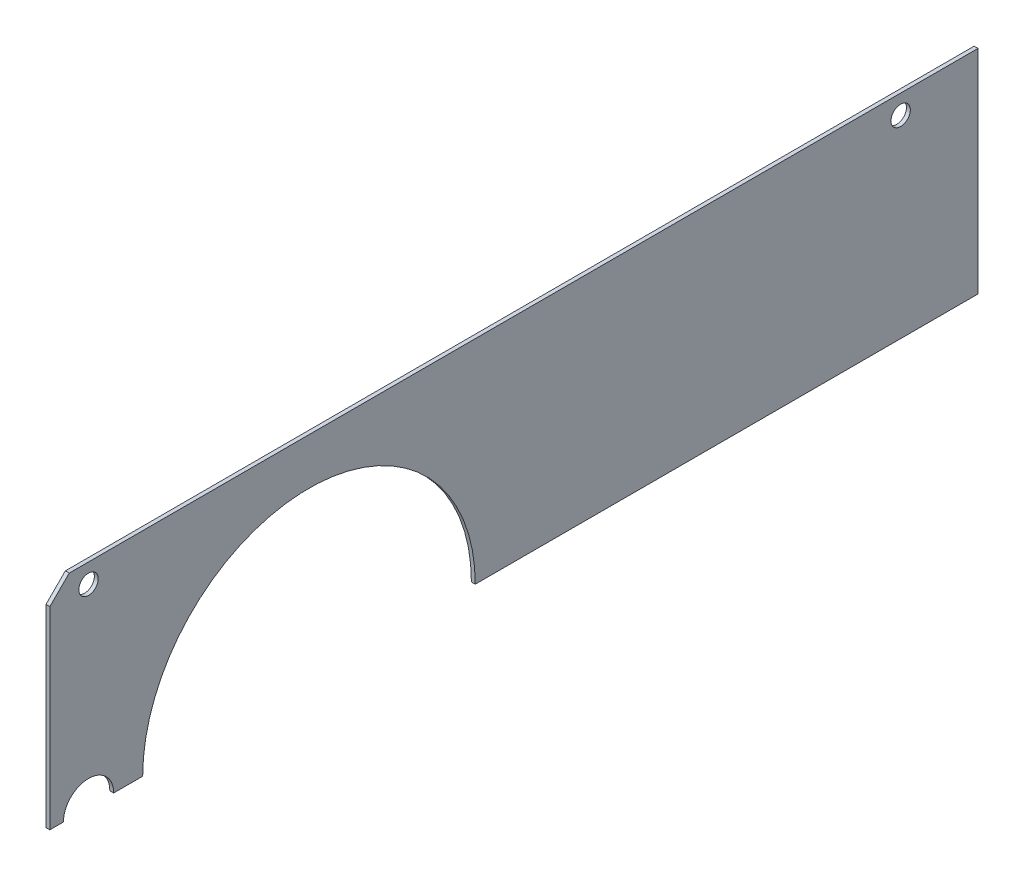
ISO-10303-21;
HEADER;
FILE_DESCRIPTION(('STEP AP214'),'2;1');
FILE_NAME('part.step','',(''),(''),'','','');
FILE_SCHEMA(('AUTOMOTIVE_DESIGN { 1 0 10303 214 1 1 1 1 }'));
ENDSEC;
DATA;
#1=APPLICATION_CONTEXT('core data for automotive mechanical design processes');
#2=APPLICATION_PROTOCOL_DEFINITION('international standard','automotive_design',2000,#1);
#3=PRODUCT_CONTEXT('',#1,'mechanical');
#4=PRODUCT('Part','Part','',(#3));
#5=PRODUCT_RELATED_PRODUCT_CATEGORY('part','',(#4));
#6=PRODUCT_DEFINITION_FORMATION('','',#4);
#7=PRODUCT_DEFINITION_CONTEXT('part definition',#1,'design');
#8=PRODUCT_DEFINITION('design','',#6,#7);
#9=PRODUCT_DEFINITION_SHAPE('','',#8);
#10=(LENGTH_UNIT() NAMED_UNIT(*) SI_UNIT(.MILLI.,.METRE.));
#11=(NAMED_UNIT(*) PLANE_ANGLE_UNIT() SI_UNIT($,.RADIAN.));
#12=(NAMED_UNIT(*) SI_UNIT($,.STERADIAN.) SOLID_ANGLE_UNIT());
#13=UNCERTAINTY_MEASURE_WITH_UNIT(LENGTH_MEASURE(1.E-05),#10,'distance_accuracy_value','');
#14=(GEOMETRIC_REPRESENTATION_CONTEXT(3) GLOBAL_UNCERTAINTY_ASSIGNED_CONTEXT((#13)) GLOBAL_UNIT_ASSIGNED_CONTEXT((#10,
#11,#12)) REPRESENTATION_CONTEXT('',''));
#15=CARTESIAN_POINT('',(0.,0.,0.));
#16=DIRECTION('',(0.,0.,1.));
#17=DIRECTION('',(1.,0.,0.));
#18=AXIS2_PLACEMENT_3D('',#15,#16,#17);
#19=CARTESIAN_POINT('',(0.,27.5,-120.));
#20=DIRECTION('',(1.,0.,0.));
#21=DIRECTION('',(0.,1.,0.));
#22=AXIS2_PLACEMENT_3D('',#19,#20,#21);
#23=PLANE('',#22);
#24=CARTESIAN_POINT('',(0.,50.,-220.));
#25=DIRECTION('',(-1.,0.,0.));
#26=DIRECTION('',(0.,-1.,0.));
#27=AXIS2_PLACEMENT_3D('',#24,#25,#26);
#28=CIRCLE('',#27,2.5);
#29=CARTESIAN_POINT('',(0.,52.5,-220.));
#30=VERTEX_POINT('',#29);
#31=EDGE_CURVE('E21',#30,#30,#28,.T.);
#32=ORIENTED_EDGE('',*,*,#31,.F.);
#33=EDGE_LOOP('',(#32));
#34=FACE_BOUND('',#33,.T.);
#35=CARTESIAN_POINT('',(0.,50.,-10.));
#36=DIRECTION('',(-1.,0.,0.));
#37=DIRECTION('',(0.,-1.,0.));
#38=AXIS2_PLACEMENT_3D('',#35,#36,#37);
#39=CIRCLE('',#38,2.5);
#40=CARTESIAN_POINT('',(0.,52.5,-10.));
#41=VERTEX_POINT('',#40);
#42=EDGE_CURVE('E144',#41,#41,#39,.T.);
#43=ORIENTED_EDGE('',*,*,#42,.F.);
#44=EDGE_LOOP('',(#43));
#45=FACE_BOUND('',#44,.T.);
#46=DIRECTION('',(0.,-1.,0.));
#47=VECTOR('',#46,1.);
#48=CARTESIAN_POINT('',(0.,50.,0.));
#49=LINE('',#48,#47);
#50=CARTESIAN_POINT('',(0.,50.,0.));
#51=VERTEX_POINT('',#50);
#52=CARTESIAN_POINT('',(0.,0.,0.));
#53=VERTEX_POINT('',#52);
#54=EDGE_CURVE('E28',#51,#53,#49,.T.);
#55=ORIENTED_EDGE('',*,*,#54,.F.);
#56=DIRECTION('',(0.,-0.707106781186548,0.707106781186548));
#57=VECTOR('',#56,1.);
#58=CARTESIAN_POINT('',(0.,55.,-5.));
#59=LINE('',#58,#57);
#60=CARTESIAN_POINT('',(0.,55.,-5.));
#61=VERTEX_POINT('',#60);
#62=EDGE_CURVE('E135',#61,#51,#59,.T.);
#63=ORIENTED_EDGE('',*,*,#62,.F.);
#64=DIRECTION('',(0.,0.,1.));
#65=VECTOR('',#64,1.);
#66=CARTESIAN_POINT('',(0.,55.,-240.));
#67=LINE('',#66,#65);
#68=CARTESIAN_POINT('',(0.,55.,-240.));
#69=VERTEX_POINT('',#68);
#70=EDGE_CURVE('E169',#69,#61,#67,.T.);
#71=ORIENTED_EDGE('',*,*,#70,.F.);
#72=DIRECTION('',(0.,1.,0.));
#73=VECTOR('',#72,1.);
#74=CARTESIAN_POINT('',(0.,0.,-240.));
#75=LINE('',#74,#73);
#76=CARTESIAN_POINT('',(0.,0.,-240.));
#77=VERTEX_POINT('',#76);
#78=EDGE_CURVE('E149',#77,#69,#75,.T.);
#79=ORIENTED_EDGE('',*,*,#78,.F.);
#80=DIRECTION('',(0.,0.,-1.));
#81=VECTOR('',#80,1.);
#82=CARTESIAN_POINT('',(0.,0.,-110.));
#83=LINE('',#82,#81);
#84=CARTESIAN_POINT('',(0.,0.,-110.));
#85=VERTEX_POINT('',#84);
#86=EDGE_CURVE('E208',#85,#77,#83,.T.);
#87=ORIENTED_EDGE('',*,*,#86,.F.);
#88=CARTESIAN_POINT('',(0.,0.,-67.));
#89=DIRECTION('',(-1.,0.,0.));
#90=DIRECTION('',(0.,0.,1.));
#91=AXIS2_PLACEMENT_3D('',#88,#89,#90);
#92=CIRCLE('',#91,43.);
#93=CARTESIAN_POINT('',(0.,0.,-24.));
#94=VERTEX_POINT('',#93);
#95=EDGE_CURVE('E161',#94,#85,#92,.T.);
#96=ORIENTED_EDGE('',*,*,#95,.F.);
#97=DIRECTION('',(0.,0.,-1.));
#98=VECTOR('',#97,1.);
#99=CARTESIAN_POINT('',(0.,0.,-16.5));
#100=LINE('',#99,#98);
#101=CARTESIAN_POINT('',(0.,0.,-16.5));
#102=VERTEX_POINT('',#101);
#103=EDGE_CURVE('E128',#102,#94,#100,.T.);
#104=ORIENTED_EDGE('',*,*,#103,.F.);
#105=CARTESIAN_POINT('',(0.,0.,-10.));
#106=DIRECTION('',(-1.,0.,0.));
#107=DIRECTION('',(0.,0.,1.));
#108=AXIS2_PLACEMENT_3D('',#105,#106,#107);
#109=CIRCLE('',#108,6.5);
#110=CARTESIAN_POINT('',(0.,0.,-3.5));
#111=VERTEX_POINT('',#110);
#112=EDGE_CURVE('E113',#111,#102,#109,.T.);
#113=ORIENTED_EDGE('',*,*,#112,.F.);
#114=DIRECTION('',(0.,0.,-1.));
#115=VECTOR('',#114,1.);
#116=CARTESIAN_POINT('',(0.,0.,0.));
#117=LINE('',#116,#115);
#118=EDGE_CURVE('E141',#53,#111,#117,.T.);
#119=ORIENTED_EDGE('',*,*,#118,.F.);
#120=EDGE_LOOP('',(#55,#63,#71,#79,#87,#96,#104,#113,#119));
#121=FACE_BOUND('',#120,.T.);
#122=ADVANCED_FACE('F17',(#34,#45,#121),#23,.F.);
#123=CARTESIAN_POINT('',(1.,27.5,-120.));
#124=DIRECTION('',(1.,0.,0.));
#125=DIRECTION('',(0.,1.,0.));
#126=AXIS2_PLACEMENT_3D('',#123,#124,#125);
#127=PLANE('',#126);
#128=CARTESIAN_POINT('',(1.,50.,-220.));
#129=DIRECTION('',(-1.,0.,0.));
#130=DIRECTION('',(0.,-1.,0.));
#131=AXIS2_PLACEMENT_3D('',#128,#129,#130);
#132=CIRCLE('',#131,2.5);
#133=CARTESIAN_POINT('',(1.,52.5,-220.));
#134=VERTEX_POINT('',#133);
#135=EDGE_CURVE('E194',#134,#134,#132,.T.);
#136=ORIENTED_EDGE('',*,*,#135,.T.);
#137=EDGE_LOOP('',(#136));
#138=FACE_BOUND('',#137,.T.);
#139=CARTESIAN_POINT('',(1.,50.,-10.));
#140=DIRECTION('',(-1.,0.,0.));
#141=DIRECTION('',(0.,-1.,0.));
#142=AXIS2_PLACEMENT_3D('',#139,#140,#141);
#143=CIRCLE('',#142,2.5);
#144=CARTESIAN_POINT('',(1.,52.5,-10.));
#145=VERTEX_POINT('',#144);
#146=EDGE_CURVE('E187',#145,#145,#143,.T.);
#147=ORIENTED_EDGE('',*,*,#146,.T.);
#148=EDGE_LOOP('',(#147));
#149=FACE_BOUND('',#148,.T.);
#150=DIRECTION('',(0.,-1.,0.));
#151=VECTOR('',#150,1.);
#152=CARTESIAN_POINT('',(1.,50.,0.));
#153=LINE('',#152,#151);
#154=CARTESIAN_POINT('',(1.,50.,0.));
#155=VERTEX_POINT('',#154);
#156=CARTESIAN_POINT('',(1.,0.,0.));
#157=VERTEX_POINT('',#156);
#158=EDGE_CURVE('E11',#155,#157,#153,.T.);
#159=ORIENTED_EDGE('',*,*,#158,.T.);
#160=DIRECTION('',(0.,0.,-1.));
#161=VECTOR('',#160,1.);
#162=CARTESIAN_POINT('',(1.,0.,0.));
#163=LINE('',#162,#161);
#164=CARTESIAN_POINT('',(1.,0.,-3.5));
#165=VERTEX_POINT('',#164);
#166=EDGE_CURVE('E107',#157,#165,#163,.T.);
#167=ORIENTED_EDGE('',*,*,#166,.T.);
#168=CARTESIAN_POINT('',(1.,0.,-10.));
#169=DIRECTION('',(-1.,0.,0.));
#170=DIRECTION('',(0.,0.,1.));
#171=AXIS2_PLACEMENT_3D('',#168,#169,#170);
#172=CIRCLE('',#171,6.5);
#173=CARTESIAN_POINT('',(1.,0.,-16.5));
#174=VERTEX_POINT('',#173);
#175=EDGE_CURVE('E100',#165,#174,#172,.T.);
#176=ORIENTED_EDGE('',*,*,#175,.T.);
#177=DIRECTION('',(0.,0.,-1.));
#178=VECTOR('',#177,1.);
#179=CARTESIAN_POINT('',(1.,0.,-16.5));
#180=LINE('',#179,#178);
#181=CARTESIAN_POINT('',(1.,0.,-24.));
#182=VERTEX_POINT('',#181);
#183=EDGE_CURVE('E104',#174,#182,#180,.T.);
#184=ORIENTED_EDGE('',*,*,#183,.T.);
#185=CARTESIAN_POINT('',(1.,0.,-67.));
#186=DIRECTION('',(-1.,0.,0.));
#187=DIRECTION('',(0.,0.,1.));
#188=AXIS2_PLACEMENT_3D('',#185,#186,#187);
#189=CIRCLE('',#188,43.);
#190=CARTESIAN_POINT('',(1.,0.,-110.));
#191=VERTEX_POINT('',#190);
#192=EDGE_CURVE('E177',#182,#191,#189,.T.);
#193=ORIENTED_EDGE('',*,*,#192,.T.);
#194=DIRECTION('',(0.,0.,-1.));
#195=VECTOR('',#194,1.);
#196=CARTESIAN_POINT('',(1.,0.,-110.));
#197=LINE('',#196,#195);
#198=CARTESIAN_POINT('',(1.,0.,-240.));
#199=VERTEX_POINT('',#198);
#200=EDGE_CURVE('E162',#191,#199,#197,.T.);
#201=ORIENTED_EDGE('',*,*,#200,.T.);
#202=DIRECTION('',(0.,1.,0.));
#203=VECTOR('',#202,1.);
#204=CARTESIAN_POINT('',(1.,0.,-240.));
#205=LINE('',#204,#203);
#206=CARTESIAN_POINT('',(1.,55.,-240.));
#207=VERTEX_POINT('',#206);
#208=EDGE_CURVE('E153',#199,#207,#205,.T.);
#209=ORIENTED_EDGE('',*,*,#208,.T.);
#210=DIRECTION('',(0.,0.,1.));
#211=VECTOR('',#210,1.);
#212=CARTESIAN_POINT('',(1.,55.,-240.));
#213=LINE('',#212,#211);
#214=CARTESIAN_POINT('',(1.,55.,-5.));
#215=VERTEX_POINT('',#214);
#216=EDGE_CURVE('E166',#207,#215,#213,.T.);
#217=ORIENTED_EDGE('',*,*,#216,.T.);
#218=DIRECTION('',(0.,-0.707106781186548,0.707106781186548));
#219=VECTOR('',#218,1.);
#220=CARTESIAN_POINT('',(1.,55.,-5.));
#221=LINE('',#220,#219);
#222=EDGE_CURVE('E174',#215,#155,#221,.T.);
#223=ORIENTED_EDGE('',*,*,#222,.T.);
#224=EDGE_LOOP('',(#159,#167,#176,#184,#193,#201,#209,#217,#223));
#225=FACE_BOUND('',#224,.T.);
#226=ADVANCED_FACE('F102',(#138,#149,#225),#127,.T.);
#227=CARTESIAN_POINT('',(0.,50.,0.));
#228=DIRECTION('',(0.,0.,1.));
#229=DIRECTION('',(1.,0.,0.));
#230=AXIS2_PLACEMENT_3D('',#227,#228,#229);
#231=PLANE('',#230);
#232=ORIENTED_EDGE('',*,*,#54,.T.);
#233=DIRECTION('',(1.,0.,0.));
#234=VECTOR('',#233,1.);
#235=CARTESIAN_POINT('',(0.,0.,0.));
#236=LINE('',#235,#234);
#237=EDGE_CURVE('E140',#53,#157,#236,.T.);
#238=ORIENTED_EDGE('',*,*,#237,.T.);
#239=ORIENTED_EDGE('',*,*,#158,.F.);
#240=DIRECTION('',(1.,0.,0.));
#241=VECTOR('',#240,1.);
#242=CARTESIAN_POINT('',(0.,50.,0.));
#243=LINE('',#242,#241);
#244=EDGE_CURVE('E184',#51,#155,#243,.T.);
#245=ORIENTED_EDGE('',*,*,#244,.F.);
#246=EDGE_LOOP('',(#232,#238,#239,#245));
#247=FACE_BOUND('',#246,.T.);
#248=ADVANCED_FACE('F247',(#247),#231,.T.);
#249=CARTESIAN_POINT('',(0.,0.,0.));
#250=DIRECTION('',(0.,-1.,0.));
#251=DIRECTION('',(0.,0.,-1.));
#252=AXIS2_PLACEMENT_3D('',#249,#250,#251);
#253=PLANE('',#252);
#254=ORIENTED_EDGE('',*,*,#118,.T.);
#255=DIRECTION('',(1.,0.,0.));
#256=VECTOR('',#255,1.);
#257=CARTESIAN_POINT('',(0.,0.,-3.5));
#258=LINE('',#257,#256);
#259=EDGE_CURVE('E112',#111,#165,#258,.T.);
#260=ORIENTED_EDGE('',*,*,#259,.T.);
#261=ORIENTED_EDGE('',*,*,#166,.F.);
#262=ORIENTED_EDGE('',*,*,#237,.F.);
#263=EDGE_LOOP('',(#254,#260,#261,#262));
#264=FACE_BOUND('',#263,.T.);
#265=ADVANCED_FACE('F281',(#264),#253,.T.);
#266=CARTESIAN_POINT('',(0.,0.,-10.));
#267=DIRECTION('',(1.,0.,0.));
#268=DIRECTION('',(0.,0.,1.));
#269=AXIS2_PLACEMENT_3D('',#266,#267,#268);
#270=CYLINDRICAL_SURFACE('',#269,6.5);
#271=ORIENTED_EDGE('',*,*,#112,.T.);
#272=DIRECTION('',(1.,0.,0.));
#273=VECTOR('',#272,1.);
#274=CARTESIAN_POINT('',(0.,0.,-16.5));
#275=LINE('',#274,#273);
#276=EDGE_CURVE('E116',#102,#174,#275,.T.);
#277=ORIENTED_EDGE('',*,*,#276,.T.);
#278=ORIENTED_EDGE('',*,*,#175,.F.);
#279=ORIENTED_EDGE('',*,*,#259,.F.);
#280=EDGE_LOOP('',(#271,#277,#278,#279));
#281=FACE_BOUND('',#280,.T.);
#282=ADVANCED_FACE('F117',(#281),#270,.F.);
#283=CARTESIAN_POINT('',(0.,0.,-16.5));
#284=DIRECTION('',(0.,-1.,0.));
#285=DIRECTION('',(0.,0.,-1.));
#286=AXIS2_PLACEMENT_3D('',#283,#284,#285);
#287=PLANE('',#286);
#288=ORIENTED_EDGE('',*,*,#103,.T.);
#289=DIRECTION('',(1.,0.,0.));
#290=VECTOR('',#289,1.);
#291=CARTESIAN_POINT('',(0.,0.,-24.));
#292=LINE('',#291,#290);
#293=EDGE_CURVE('E125',#94,#182,#292,.T.);
#294=ORIENTED_EDGE('',*,*,#293,.T.);
#295=ORIENTED_EDGE('',*,*,#183,.F.);
#296=ORIENTED_EDGE('',*,*,#276,.F.);
#297=EDGE_LOOP('',(#288,#294,#295,#296));
#298=FACE_BOUND('',#297,.T.);
#299=ADVANCED_FACE('F123',(#298),#287,.T.);
#300=CARTESIAN_POINT('',(0.,0.,-67.));
#301=DIRECTION('',(1.,0.,0.));
#302=DIRECTION('',(0.,0.,1.));
#303=AXIS2_PLACEMENT_3D('',#300,#301,#302);
#304=CYLINDRICAL_SURFACE('',#303,43.);
#305=ORIENTED_EDGE('',*,*,#95,.T.);
#306=DIRECTION('',(1.,0.,0.));
#307=VECTOR('',#306,1.);
#308=CARTESIAN_POINT('',(0.,0.,-110.));
#309=LINE('',#308,#307);
#310=EDGE_CURVE('E157',#85,#191,#309,.T.);
#311=ORIENTED_EDGE('',*,*,#310,.T.);
#312=ORIENTED_EDGE('',*,*,#192,.F.);
#313=ORIENTED_EDGE('',*,*,#293,.F.);
#314=EDGE_LOOP('',(#305,#311,#312,#313));
#315=FACE_BOUND('',#314,.T.);
#316=ADVANCED_FACE('F298',(#315),#304,.F.);
#317=CARTESIAN_POINT('',(0.,0.,-110.));
#318=DIRECTION('',(0.,-1.,0.));
#319=DIRECTION('',(0.,0.,-1.));
#320=AXIS2_PLACEMENT_3D('',#317,#318,#319);
#321=PLANE('',#320);
#322=ORIENTED_EDGE('',*,*,#86,.T.);
#323=DIRECTION('',(1.,0.,0.));
#324=VECTOR('',#323,1.);
#325=CARTESIAN_POINT('',(0.,0.,-240.));
#326=LINE('',#325,#324);
#327=EDGE_CURVE('E181',#77,#199,#326,.T.);
#328=ORIENTED_EDGE('',*,*,#327,.T.);
#329=ORIENTED_EDGE('',*,*,#200,.F.);
#330=ORIENTED_EDGE('',*,*,#310,.F.);
#331=EDGE_LOOP('',(#322,#328,#329,#330));
#332=FACE_BOUND('',#331,.T.);
#333=ADVANCED_FACE('F228',(#332),#321,.T.);
#334=CARTESIAN_POINT('',(0.,0.,-240.));
#335=DIRECTION('',(0.,0.,-1.));
#336=DIRECTION('',(0.,-1.,0.));
#337=AXIS2_PLACEMENT_3D('',#334,#335,#336);
#338=PLANE('',#337);
#339=ORIENTED_EDGE('',*,*,#78,.T.);
#340=DIRECTION('',(1.,0.,0.));
#341=VECTOR('',#340,1.);
#342=CARTESIAN_POINT('',(0.,55.,-240.));
#343=LINE('',#342,#341);
#344=EDGE_CURVE('E154',#69,#207,#343,.T.);
#345=ORIENTED_EDGE('',*,*,#344,.T.);
#346=ORIENTED_EDGE('',*,*,#208,.F.);
#347=ORIENTED_EDGE('',*,*,#327,.F.);
#348=EDGE_LOOP('',(#339,#345,#346,#347));
#349=FACE_BOUND('',#348,.T.);
#350=ADVANCED_FACE('F232',(#349),#338,.T.);
#351=CARTESIAN_POINT('',(0.,55.,-240.));
#352=DIRECTION('',(0.,1.,0.));
#353=DIRECTION('',(1.,0.,0.));
#354=AXIS2_PLACEMENT_3D('',#351,#352,#353);
#355=PLANE('',#354);
#356=ORIENTED_EDGE('',*,*,#70,.T.);
#357=DIRECTION('',(1.,0.,0.));
#358=VECTOR('',#357,1.);
#359=CARTESIAN_POINT('',(0.,55.,-5.));
#360=LINE('',#359,#358);
#361=EDGE_CURVE('E170',#61,#215,#360,.T.);
#362=ORIENTED_EDGE('',*,*,#361,.T.);
#363=ORIENTED_EDGE('',*,*,#216,.F.);
#364=ORIENTED_EDGE('',*,*,#344,.F.);
#365=EDGE_LOOP('',(#356,#362,#363,#364));
#366=FACE_BOUND('',#365,.T.);
#367=ADVANCED_FACE('F19',(#366),#355,.T.);
#368=CARTESIAN_POINT('',(0.,55.,-5.));
#369=DIRECTION('',(0.,0.707106781186548,0.707106781186548));
#370=DIRECTION('',(1.,0.,0.));
#371=AXIS2_PLACEMENT_3D('',#368,#369,#370);
#372=PLANE('',#371);
#373=ORIENTED_EDGE('',*,*,#62,.T.);
#374=ORIENTED_EDGE('',*,*,#244,.T.);
#375=ORIENTED_EDGE('',*,*,#222,.F.);
#376=ORIENTED_EDGE('',*,*,#361,.F.);
#377=EDGE_LOOP('',(#373,#374,#375,#376));
#378=FACE_BOUND('',#377,.T.);
#379=ADVANCED_FACE('F244',(#378),#372,.T.);
#380=CARTESIAN_POINT('',(0.,50.,-10.));
#381=DIRECTION('',(1.,0.,0.));
#382=DIRECTION('',(0.,-1.,0.));
#383=AXIS2_PLACEMENT_3D('',#380,#381,#382);
#384=CYLINDRICAL_SURFACE('',#383,2.5);
#385=ORIENTED_EDGE('',*,*,#146,.F.);
#386=DIRECTION('',(-1.,0.,0.));
#387=VECTOR('',#386,1.);
#388=CARTESIAN_POINT('',(0.,52.5,-10.));
#389=LINE('',#388,#387);
#390=EDGE_CURVE('E148',#145,#41,#389,.T.);
#391=ORIENTED_EDGE('',*,*,#390,.T.);
#392=ORIENTED_EDGE('',*,*,#42,.T.);
#393=ORIENTED_EDGE('',*,*,#390,.F.);
#394=EDGE_LOOP('',(#385,#391,#392,#393));
#395=FACE_BOUND('',#394,.T.);
#396=ADVANCED_FACE('F267',(#395),#384,.F.);
#397=CARTESIAN_POINT('',(0.,50.,-220.));
#398=DIRECTION('',(1.,0.,0.));
#399=DIRECTION('',(0.,-1.,0.));
#400=AXIS2_PLACEMENT_3D('',#397,#398,#399);
#401=CYLINDRICAL_SURFACE('',#400,2.5);
#402=ORIENTED_EDGE('',*,*,#135,.F.);
#403=DIRECTION('',(-1.,0.,0.));
#404=VECTOR('',#403,1.);
#405=CARTESIAN_POINT('',(0.,52.5,-220.));
#406=LINE('',#405,#404);
#407=EDGE_CURVE('E191',#134,#30,#406,.T.);
#408=ORIENTED_EDGE('',*,*,#407,.T.);
#409=ORIENTED_EDGE('',*,*,#31,.T.);
#410=ORIENTED_EDGE('',*,*,#407,.F.);
#411=EDGE_LOOP('',(#402,#408,#409,#410));
#412=FACE_BOUND('',#411,.T.);
#413=ADVANCED_FACE('F284',(#412),#401,.F.);
#414=CLOSED_SHELL('',(#122,#226,#248,#265,#282,#299,#316,#333,#350,#367,#379,#396,#413));
#415=MANIFOLD_SOLID_BREP('B1',#414);
#416=ADVANCED_BREP_SHAPE_REPRESENTATION('',(#18,#415),#14);
#417=SHAPE_DEFINITION_REPRESENTATION(#9,#416);
ENDSEC;
END-ISO-10303-21;
